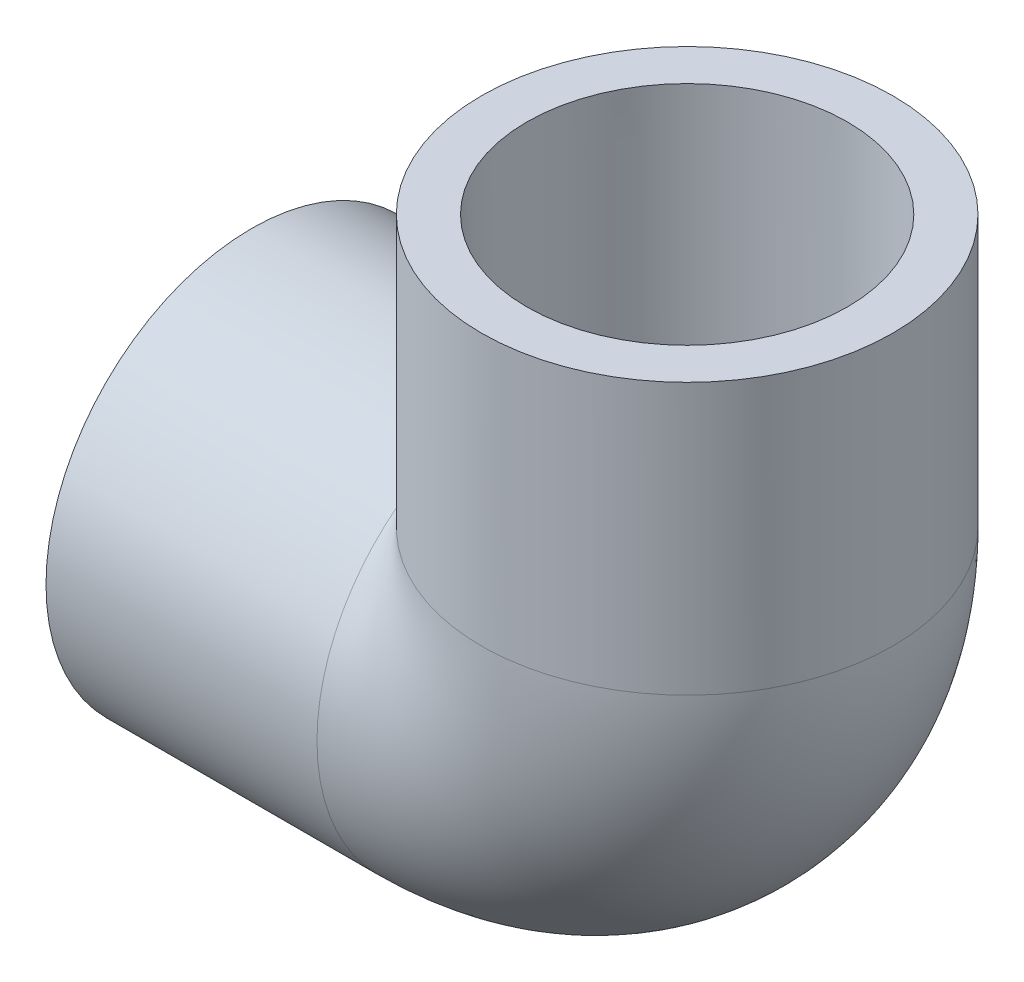
ISO-10303-21;
HEADER;
FILE_DESCRIPTION(('STEP AP214'),'2;1');
FILE_NAME('part.step','',(''),(''),'','','');
FILE_SCHEMA(('AUTOMOTIVE_DESIGN { 1 0 10303 214 1 1 1 1 }'));
ENDSEC;
DATA;
#1=APPLICATION_CONTEXT('core data for automotive mechanical design processes');
#2=APPLICATION_PROTOCOL_DEFINITION('international standard','automotive_design',2000,#1);
#3=PRODUCT_CONTEXT('',#1,'mechanical');
#4=PRODUCT('Part','Part','',(#3));
#5=PRODUCT_RELATED_PRODUCT_CATEGORY('part','',(#4));
#6=PRODUCT_DEFINITION_FORMATION('','',#4);
#7=PRODUCT_DEFINITION_CONTEXT('part definition',#1,'design');
#8=PRODUCT_DEFINITION('design','',#6,#7);
#9=PRODUCT_DEFINITION_SHAPE('','',#8);
#10=(LENGTH_UNIT() NAMED_UNIT(*) SI_UNIT(.MILLI.,.METRE.));
#11=(NAMED_UNIT(*) PLANE_ANGLE_UNIT() SI_UNIT($,.RADIAN.));
#12=(NAMED_UNIT(*) SI_UNIT($,.STERADIAN.) SOLID_ANGLE_UNIT());
#13=UNCERTAINTY_MEASURE_WITH_UNIT(LENGTH_MEASURE(1.E-05),#10,'distance_accuracy_value','');
#14=(GEOMETRIC_REPRESENTATION_CONTEXT(3) GLOBAL_UNCERTAINTY_ASSIGNED_CONTEXT((#13)) GLOBAL_UNIT_ASSIGNED_CONTEXT((#10,
#11,#12)) REPRESENTATION_CONTEXT('',''));
#15=CARTESIAN_POINT('',(0.,0.,0.));
#16=DIRECTION('',(0.,0.,1.));
#17=DIRECTION('',(1.,0.,0.));
#18=AXIS2_PLACEMENT_3D('',#15,#16,#17);
#19=CARTESIAN_POINT('',(-45.72,-21.59,0.));
#20=DIRECTION('',(-1.,0.,0.));
#21=DIRECTION('',(0.,0.,1.));
#22=AXIS2_PLACEMENT_3D('',#19,#20,#21);
#23=PLANE('',#22);
#24=CARTESIAN_POINT('',(-45.72,0.,0.));
#25=DIRECTION('',(-1.,0.,0.));
#26=DIRECTION('',(0.,0.,1.));
#27=AXIS2_PLACEMENT_3D('',#24,#25,#26);
#28=CIRCLE('',#27,21.59);
#29=CARTESIAN_POINT('',(-45.72,0.,21.59));
#30=VERTEX_POINT('',#29);
#31=EDGE_CURVE('E52',#30,#30,#28,.T.);
#32=ORIENTED_EDGE('',*,*,#31,.T.);
#33=EDGE_LOOP('',(#32));
#34=FACE_BOUND('',#33,.T.);
#35=CARTESIAN_POINT('',(-45.72,0.,0.));
#36=DIRECTION('',(-1.,0.,0.));
#37=DIRECTION('',(0.,0.,1.));
#38=AXIS2_PLACEMENT_3D('',#35,#36,#37);
#39=CIRCLE('',#38,16.8275);
#40=CARTESIAN_POINT('',(-45.72,0.,16.8275));
#41=VERTEX_POINT('',#40);
#42=EDGE_CURVE('E39',#41,#41,#39,.T.);
#43=ORIENTED_EDGE('',*,*,#42,.F.);
#44=EDGE_LOOP('',(#43));
#45=FACE_BOUND('',#44,.T.);
#46=ADVANCED_FACE('F32',(#34,#45),#23,.T.);
#47=CARTESIAN_POINT('',(-17.272,0.,0.));
#48=DIRECTION('',(-1.,0.,0.));
#49=DIRECTION('',(0.,0.,1.));
#50=AXIS2_PLACEMENT_3D('',#47,#48,#49);
#51=CONICAL_SURFACE('',#50,16.637,0.00669632848002419);
#52=ORIENTED_EDGE('',*,*,#42,.T.);
#53=EDGE_LOOP('',(#52));
#54=FACE_BOUND('',#53,.T.);
#55=CARTESIAN_POINT('',(-17.272,0.,0.));
#56=DIRECTION('',(-1.,0.,0.));
#57=DIRECTION('',(0.,0.,1.));
#58=AXIS2_PLACEMENT_3D('',#55,#56,#57);
#59=CIRCLE('',#58,16.637);
#60=CARTESIAN_POINT('',(-17.272,0.,16.637));
#61=VERTEX_POINT('',#60);
#62=EDGE_CURVE('E63',#61,#61,#59,.T.);
#63=ORIENTED_EDGE('',*,*,#62,.F.);
#64=EDGE_LOOP('',(#63));
#65=FACE_BOUND('',#64,.T.);
#66=ADVANCED_FACE('F72',(#54,#65),#51,.F.);
#67=CARTESIAN_POINT('',(-45.72,0.,0.));
#68=DIRECTION('',(-1.,0.,0.));
#69=DIRECTION('',(0.,0.,1.));
#70=AXIS2_PLACEMENT_3D('',#67,#68,#69);
#71=CYLINDRICAL_SURFACE('',#70,21.59);
#72=CARTESIAN_POINT('',(0.,0.,0.));
#73=DIRECTION('',(-0.707106781186547,-0.707106781186547,0.));
#74=DIRECTION('',(-0.707106781186547,0.707106781186547,0.));
#75=AXIS2_PLACEMENT_3D('',#72,#73,#74);
#76=ELLIPSE('',#75,30.5328708116351,21.59);
#77=CARTESIAN_POINT('',(-17.272,17.272,-12.954));
#78=VERTEX_POINT('',#77);
#79=CARTESIAN_POINT('',(-17.272,17.272,12.954));
#80=VERTEX_POINT('',#79);
#81=EDGE_CURVE('E51',#78,#80,#76,.F.);
#82=ORIENTED_EDGE('',*,*,#81,.F.);
#83=CARTESIAN_POINT('',(-17.272,0.,0.));
#84=DIRECTION('',(-1.,0.,0.));
#85=DIRECTION('',(0.,0.,1.));
#86=AXIS2_PLACEMENT_3D('',#83,#84,#85);
#87=CIRCLE('',#86,21.59);
#88=EDGE_CURVE('E58',#78,#80,#87,.T.);
#89=ORIENTED_EDGE('',*,*,#88,.T.);
#90=EDGE_LOOP('',(#82,#89));
#91=FACE_BOUND('',#90,.T.);
#92=ORIENTED_EDGE('',*,*,#31,.F.);
#93=EDGE_LOOP('',(#92));
#94=FACE_BOUND('',#93,.T.);
#95=ADVANCED_FACE('F56',(#91,#94),#71,.T.);
#96=CARTESIAN_POINT('',(-17.272,17.272,0.));
#97=DIRECTION('',(0.,0.,-1.));
#98=DIRECTION('',(-1.,0.,0.));
#99=AXIS2_PLACEMENT_3D('',#96,#97,#98);
#100=TOROIDAL_SURFACE('',#99,17.272,12.1539);
#101=CARTESIAN_POINT('',(0.,17.272,0.));
#102=DIRECTION('',(0.,1.,0.));
#103=DIRECTION('',(0.,0.,-1.));
#104=AXIS2_PLACEMENT_3D('',#101,#102,#103);
#105=CIRCLE('',#104,12.1539);
#106=CARTESIAN_POINT('',(12.1539,17.272,0.));
#107=VERTEX_POINT('',#106);
#108=EDGE_CURVE('E53',#107,#107,#105,.T.);
#109=CARTESIAN_POINT('',(-17.272,0.,0.));
#110=DIRECTION('',(1.,0.,0.));
#111=DIRECTION('',(0.,0.,-1.));
#112=AXIS2_PLACEMENT_3D('',#109,#110,#111);
#113=CIRCLE('',#112,12.1539);
#114=CARTESIAN_POINT('',(-17.272,-12.1539,0.));
#115=VERTEX_POINT('',#114);
#116=EDGE_CURVE('E59',#115,#115,#113,.T.);
#117=CARTESIAN_POINT('',(-17.272,17.272,0.));
#118=DIRECTION('',(0.,0.,-1.));
#119=DIRECTION('',(-1.,0.,0.));
#120=AXIS2_PLACEMENT_3D('',#117,#118,#119);
#121=CIRCLE('',#120,29.4259);
#122=EDGE_CURVE('',#107,#115,#121,.T.);
#123=ORIENTED_EDGE('',*,*,#108,.T.);
#124=ORIENTED_EDGE('',*,*,#116,.F.);
#125=ORIENTED_EDGE('',*,*,#122,.T.);
#126=ORIENTED_EDGE('',*,*,#122,.F.);
#127=EDGE_LOOP('',(#123,#125,#124,#126));
#128=FACE_BOUND('',#127,.T.);
#129=ADVANCED_FACE('F82',(#128),#100,.F.);
#130=CARTESIAN_POINT('',(-34.544,17.272,0.));
#131=DIRECTION('',(0.,-1.,0.));
#132=DIRECTION('',(-1.,0.,0.));
#133=AXIS2_PLACEMENT_3D('',#130,#131,#132);
#134=CIRCLE('',#133,21.59);
#135=TRIMMED_CURVE('',#134,(PARAMETER_VALUE(-2.49809154479651)),
(PARAMETER_VALUE(2.49809154479651)),.T.,.PARAMETER.);
#136=CARTESIAN_POINT('',(-17.272,17.272,0.));
#137=DIRECTION('',(0.,0.,-1.));
#138=AXIS1_PLACEMENT('',#136,#137);
#139=SURFACE_OF_REVOLUTION('',#135,#138);
#140=CARTESIAN_POINT('',(0.,17.272,0.));
#141=DIRECTION('',(0.,1.,0.));
#142=DIRECTION('',(0.,0.,-1.));
#143=AXIS2_PLACEMENT_3D('',#140,#141,#142);
#144=CIRCLE('',#143,21.59);
#145=EDGE_CURVE('E45',#80,#78,#144,.T.);
#146=ORIENTED_EDGE('',*,*,#145,.F.);
#147=ORIENTED_EDGE('',*,*,#88,.F.);
#148=EDGE_LOOP('',(#146,#147));
#149=FACE_BOUND('',#148,.T.);
#150=ADVANCED_FACE('F62',(#149),#139,.T.);
#151=CARTESIAN_POINT('',(0.,17.272,0.));
#152=DIRECTION('',(0.,1.,0.));
#153=DIRECTION('',(0.,0.,-1.));
#154=AXIS2_PLACEMENT_3D('',#151,#152,#153);
#155=PLANE('',#154);
#156=CARTESIAN_POINT('',(0.,17.272,0.));
#157=DIRECTION('',(0.,1.,0.));
#158=DIRECTION('',(-1.,0.,0.));
#159=AXIS2_PLACEMENT_3D('',#156,#157,#158);
#160=CIRCLE('',#159,16.637);
#161=CARTESIAN_POINT('',(-16.637,17.272,0.));
#162=VERTEX_POINT('',#161);
#163=EDGE_CURVE('E11',#162,#162,#160,.F.);
#164=ORIENTED_EDGE('',*,*,#163,.F.);
#165=EDGE_LOOP('',(#164));
#166=FACE_BOUND('',#165,.T.);
#167=ORIENTED_EDGE('',*,*,#108,.F.);
#168=EDGE_LOOP('',(#167));
#169=FACE_BOUND('',#168,.T.);
#170=ADVANCED_FACE('F89',(#166,#169),#155,.T.);
#171=CARTESIAN_POINT('',(-17.272,0.,0.));
#172=DIRECTION('',(1.,0.,0.));
#173=DIRECTION('',(0.,0.,-1.));
#174=AXIS2_PLACEMENT_3D('',#171,#172,#173);
#175=PLANE('',#174);
#176=ORIENTED_EDGE('',*,*,#62,.T.);
#177=EDGE_LOOP('',(#176));
#178=FACE_BOUND('',#177,.T.);
#179=ORIENTED_EDGE('',*,*,#116,.T.);
#180=EDGE_LOOP('',(#179));
#181=FACE_BOUND('',#180,.T.);
#182=ADVANCED_FACE('F92',(#178,#181),#175,.F.);
#183=CARTESIAN_POINT('',(21.59,45.72,0.));
#184=DIRECTION('',(0.,1.,0.));
#185=DIRECTION('',(0.,0.,1.));
#186=AXIS2_PLACEMENT_3D('',#183,#184,#185);
#187=PLANE('',#186);
#188=CARTESIAN_POINT('',(0.,45.72,0.));
#189=DIRECTION('',(0.,-1.,0.));
#190=DIRECTION('',(0.,0.,-1.));
#191=AXIS2_PLACEMENT_3D('',#188,#189,#190);
#192=CIRCLE('',#191,16.8275);
#193=CARTESIAN_POINT('',(0.,45.72,-16.8275));
#194=VERTEX_POINT('',#193);
#195=EDGE_CURVE('E116',#194,#194,#192,.T.);
#196=ORIENTED_EDGE('',*,*,#195,.T.);
#197=EDGE_LOOP('',(#196));
#198=FACE_BOUND('',#197,.T.);
#199=CARTESIAN_POINT('',(0.,45.72,0.));
#200=DIRECTION('',(0.,-1.,0.));
#201=DIRECTION('',(0.,0.,-1.));
#202=AXIS2_PLACEMENT_3D('',#199,#200,#201);
#203=CIRCLE('',#202,21.59);
#204=CARTESIAN_POINT('',(0.,45.72,-21.59));
#205=VERTEX_POINT('',#204);
#206=EDGE_CURVE('E60',#205,#205,#203,.T.);
#207=ORIENTED_EDGE('',*,*,#206,.F.);
#208=EDGE_LOOP('',(#207));
#209=FACE_BOUND('',#208,.T.);
#210=ADVANCED_FACE('F99',(#198,#209),#187,.T.);
#211=CARTESIAN_POINT('',(0.,0.,0.));
#212=DIRECTION('',(0.,-1.,0.));
#213=DIRECTION('',(0.,0.,-1.));
#214=AXIS2_PLACEMENT_3D('',#211,#212,#213);
#215=CYLINDRICAL_SURFACE('',#214,21.59);
#216=ORIENTED_EDGE('',*,*,#206,.T.);
#217=EDGE_LOOP('',(#216));
#218=FACE_BOUND('',#217,.T.);
#219=ORIENTED_EDGE('',*,*,#145,.T.);
#220=ORIENTED_EDGE('',*,*,#81,.T.);
#221=EDGE_LOOP('',(#219,#220));
#222=FACE_BOUND('',#221,.T.);
#223=ADVANCED_FACE('F50',(#218,#222),#215,.T.);
#224=CARTESIAN_POINT('',(0.,45.72,0.));
#225=DIRECTION('',(0.,1.,0.));
#226=DIRECTION('',(0.,0.,1.));
#227=AXIS2_PLACEMENT_3D('',#224,#225,#226);
#228=CONICAL_SURFACE('',#227,16.8275,0.00669632848002419);
#229=ORIENTED_EDGE('',*,*,#163,.T.);
#230=EDGE_LOOP('',(#229));
#231=FACE_BOUND('',#230,.T.);
#232=ORIENTED_EDGE('',*,*,#195,.F.);
#233=EDGE_LOOP('',(#232));
#234=FACE_BOUND('',#233,.T.);
#235=ADVANCED_FACE('F106',(#231,#234),#228,.F.);
#236=CLOSED_SHELL('',(#46,#66,#95,#129,#150,#170,#182,#210,#223,#235));
#237=MANIFOLD_SOLID_BREP('B2',#236);
#238=ADVANCED_BREP_SHAPE_REPRESENTATION('',(#18,#237),#14);
#239=SHAPE_DEFINITION_REPRESENTATION(#9,#238);
ENDSEC;
END-ISO-10303-21;
